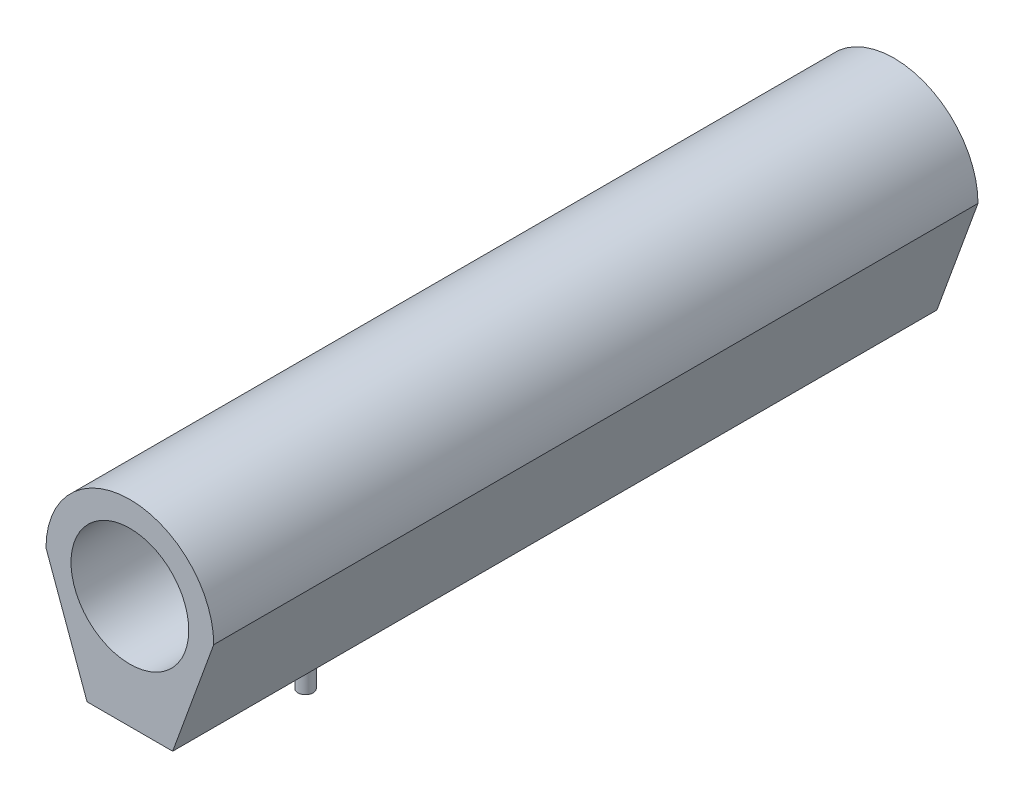
ISO-10303-21;
HEADER;
FILE_DESCRIPTION(('STEP AP214'),'2;1');
FILE_NAME('part.step','',(''),(''),'','','');
FILE_SCHEMA(('AUTOMOTIVE_DESIGN { 1 0 10303 214 1 1 1 1 }'));
ENDSEC;
DATA;
#1=APPLICATION_CONTEXT('core data for automotive mechanical design processes');
#2=APPLICATION_PROTOCOL_DEFINITION('international standard','automotive_design',2000,#1);
#3=PRODUCT_CONTEXT('',#1,'mechanical');
#4=PRODUCT('Part','Part','',(#3));
#5=PRODUCT_RELATED_PRODUCT_CATEGORY('part','',(#4));
#6=PRODUCT_DEFINITION_FORMATION('','',#4);
#7=PRODUCT_DEFINITION_CONTEXT('part definition',#1,'design');
#8=PRODUCT_DEFINITION('design','',#6,#7);
#9=PRODUCT_DEFINITION_SHAPE('','',#8);
#10=(LENGTH_UNIT() NAMED_UNIT(*) SI_UNIT(.MILLI.,.METRE.));
#11=(NAMED_UNIT(*) PLANE_ANGLE_UNIT() SI_UNIT($,.RADIAN.));
#12=(NAMED_UNIT(*) SI_UNIT($,.STERADIAN.) SOLID_ANGLE_UNIT());
#13=UNCERTAINTY_MEASURE_WITH_UNIT(LENGTH_MEASURE(1.E-05),#10,'distance_accuracy_value','');
#14=(GEOMETRIC_REPRESENTATION_CONTEXT(3) GLOBAL_UNCERTAINTY_ASSIGNED_CONTEXT((#13)) GLOBAL_UNIT_ASSIGNED_CONTEXT((#10,
#11,#12)) REPRESENTATION_CONTEXT('',''));
#15=CARTESIAN_POINT('',(0.,0.,0.));
#16=DIRECTION('',(0.,0.,1.));
#17=DIRECTION('',(1.,0.,0.));
#18=AXIS2_PLACEMENT_3D('',#15,#16,#17);
#19=CARTESIAN_POINT('',(-13.75,0.,0.));
#20=DIRECTION('',(-0.939692620785908,-0.34202014332567,0.));
#21=DIRECTION('',(0.34202014332567,-0.939692620785908,0.));
#22=AXIS2_PLACEMENT_3D('',#19,#20,#21);
#23=PLANE('',#22);
#24=DIRECTION('',(0.34202014332567,-0.939692620785908,0.));
#25=VECTOR('',#24,1.);
#26=CARTESIAN_POINT('',(-13.75,0.,125.3));
#27=LINE('',#26,#25);
#28=CARTESIAN_POINT('',(-13.75,0.,125.3));
#29=VERTEX_POINT('',#28);
#30=CARTESIAN_POINT('',(-7.01655066607523,-18.5,125.3));
#31=VERTEX_POINT('',#30);
#32=EDGE_CURVE('E103',#29,#31,#27,.T.);
#33=ORIENTED_EDGE('',*,*,#32,.F.);
#34=DIRECTION('',(0.,0.,1.));
#35=VECTOR('',#34,1.);
#36=CARTESIAN_POINT('',(-13.75,0.,0.));
#37=LINE('',#36,#35);
#38=CARTESIAN_POINT('',(-13.75,0.,0.));
#39=VERTEX_POINT('',#38);
#40=EDGE_CURVE('E44',#39,#29,#37,.T.);
#41=ORIENTED_EDGE('',*,*,#40,.F.);
#42=DIRECTION('',(0.34202014332567,-0.939692620785908,0.));
#43=VECTOR('',#42,1.);
#44=CARTESIAN_POINT('',(-13.75,0.,0.));
#45=LINE('',#44,#43);
#46=CARTESIAN_POINT('',(-7.01655066607523,-18.5,0.));
#47=VERTEX_POINT('',#46);
#48=EDGE_CURVE('E96',#39,#47,#45,.T.);
#49=ORIENTED_EDGE('',*,*,#48,.T.);
#50=DIRECTION('',(0.,0.,1.));
#51=VECTOR('',#50,1.);
#52=CARTESIAN_POINT('',(-7.01655066607523,-18.5,0.));
#53=LINE('',#52,#51);
#54=EDGE_CURVE('E79',#47,#31,#53,.T.);
#55=ORIENTED_EDGE('',*,*,#54,.T.);
#56=EDGE_LOOP('',(#33,#41,#49,#55));
#57=FACE_BOUND('',#56,.T.);
#58=ADVANCED_FACE('F36',(#57),#23,.T.);
#59=CARTESIAN_POINT('',(0.,0.,0.));
#60=DIRECTION('',(0.,0.,1.));
#61=DIRECTION('',(1.,0.,0.));
#62=AXIS2_PLACEMENT_3D('',#59,#60,#61);
#63=CYLINDRICAL_SURFACE('',#62,13.75);
#64=CARTESIAN_POINT('',(0.,0.,125.3));
#65=DIRECTION('',(0.,0.,1.));
#66=DIRECTION('',(1.,0.,0.));
#67=AXIS2_PLACEMENT_3D('',#64,#65,#66);
#68=CIRCLE('',#67,13.75);
#69=CARTESIAN_POINT('',(13.75,0.,125.3));
#70=VERTEX_POINT('',#69);
#71=EDGE_CURVE('E98',#70,#29,#68,.T.);
#72=ORIENTED_EDGE('',*,*,#71,.F.);
#73=DIRECTION('',(0.,0.,1.));
#74=VECTOR('',#73,1.);
#75=CARTESIAN_POINT('',(13.75,0.,0.));
#76=LINE('',#75,#74);
#77=CARTESIAN_POINT('',(13.75,0.,0.));
#78=VERTEX_POINT('',#77);
#79=EDGE_CURVE('E68',#78,#70,#76,.T.);
#80=ORIENTED_EDGE('',*,*,#79,.F.);
#81=CARTESIAN_POINT('',(0.,0.,0.));
#82=DIRECTION('',(0.,0.,1.));
#83=DIRECTION('',(1.,0.,0.));
#84=AXIS2_PLACEMENT_3D('',#81,#82,#83);
#85=CIRCLE('',#84,13.75);
#86=EDGE_CURVE('E93',#78,#39,#85,.T.);
#87=ORIENTED_EDGE('',*,*,#86,.T.);
#88=ORIENTED_EDGE('',*,*,#40,.T.);
#89=EDGE_LOOP('',(#72,#80,#87,#88));
#90=FACE_BOUND('',#89,.T.);
#91=ADVANCED_FACE('F115',(#90),#63,.T.);
#92=CARTESIAN_POINT('',(13.75,0.,0.));
#93=DIRECTION('',(0.939692620785908,-0.34202014332567,0.));
#94=DIRECTION('',(0.34202014332567,0.939692620785908,0.));
#95=AXIS2_PLACEMENT_3D('',#92,#93,#94);
#96=PLANE('',#95);
#97=DIRECTION('',(0.34202014332567,0.939692620785908,0.));
#98=VECTOR('',#97,1.);
#99=CARTESIAN_POINT('',(13.75,0.,125.3));
#100=LINE('',#99,#98);
#101=CARTESIAN_POINT('',(7.01655066607523,-18.5,125.3));
#102=VERTEX_POINT('',#101);
#103=EDGE_CURVE('E87',#102,#70,#100,.T.);
#104=ORIENTED_EDGE('',*,*,#103,.F.);
#105=DIRECTION('',(0.,0.,1.));
#106=VECTOR('',#105,1.);
#107=CARTESIAN_POINT('',(7.01655066607523,-18.5,0.));
#108=LINE('',#107,#106);
#109=CARTESIAN_POINT('',(7.01655066607523,-18.5,0.));
#110=VERTEX_POINT('',#109);
#111=EDGE_CURVE('E82',#110,#102,#108,.T.);
#112=ORIENTED_EDGE('',*,*,#111,.F.);
#113=DIRECTION('',(0.34202014332567,0.939692620785908,0.));
#114=VECTOR('',#113,1.);
#115=CARTESIAN_POINT('',(13.75,0.,0.));
#116=LINE('',#115,#114);
#117=EDGE_CURVE('E85',#110,#78,#116,.T.);
#118=ORIENTED_EDGE('',*,*,#117,.T.);
#119=ORIENTED_EDGE('',*,*,#79,.T.);
#120=EDGE_LOOP('',(#104,#112,#118,#119));
#121=FACE_BOUND('',#120,.T.);
#122=ADVANCED_FACE('F84',(#121),#96,.T.);
#123=CARTESIAN_POINT('',(-7.01655066607523,-18.5,0.));
#124=DIRECTION('',(0.,-1.,0.));
#125=DIRECTION('',(0.,0.,-1.));
#126=AXIS2_PLACEMENT_3D('',#123,#124,#125);
#127=PLANE('',#126);
#128=CARTESIAN_POINT('',(0.,-18.5,96.5));
#129=DIRECTION('',(0.,-1.,0.));
#130=DIRECTION('',(0.,0.,-1.));
#131=AXIS2_PLACEMENT_3D('',#128,#129,#130);
#132=CIRCLE('',#131,5.75000000000001);
#133=CARTESIAN_POINT('',(0.,-18.5,90.75));
#134=VERTEX_POINT('',#133);
#135=EDGE_CURVE('E11',#134,#134,#132,.T.);
#136=ORIENTED_EDGE('',*,*,#135,.F.);
#137=EDGE_LOOP('',(#136));
#138=FACE_BOUND('',#137,.T.);
#139=DIRECTION('',(1.,0.,0.));
#140=VECTOR('',#139,1.);
#141=CARTESIAN_POINT('',(-7.01655066607523,-18.5,125.3));
#142=LINE('',#141,#140);
#143=EDGE_CURVE('E106',#31,#102,#142,.T.);
#144=ORIENTED_EDGE('',*,*,#143,.F.);
#145=ORIENTED_EDGE('',*,*,#54,.F.);
#146=DIRECTION('',(1.,0.,0.));
#147=VECTOR('',#146,1.);
#148=CARTESIAN_POINT('',(-7.01655066607523,-18.5,0.));
#149=LINE('',#148,#147);
#150=EDGE_CURVE('E92',#47,#110,#149,.T.);
#151=ORIENTED_EDGE('',*,*,#150,.T.);
#152=ORIENTED_EDGE('',*,*,#111,.T.);
#153=EDGE_LOOP('',(#144,#145,#151,#152));
#154=FACE_BOUND('',#153,.T.);
#155=ADVANCED_FACE('F95',(#138,#154),#127,.T.);
#156=CARTESIAN_POINT('',(0.,0.,0.));
#157=DIRECTION('',(0.,0.,1.));
#158=DIRECTION('',(1.,0.,0.));
#159=AXIS2_PLACEMENT_3D('',#156,#157,#158);
#160=PLANE('',#159);
#161=CARTESIAN_POINT('',(0.,0.,0.));
#162=DIRECTION('',(0.,0.,1.));
#163=DIRECTION('',(1.,0.,0.));
#164=AXIS2_PLACEMENT_3D('',#161,#162,#163);
#165=CIRCLE('',#164,9.65);
#166=CARTESIAN_POINT('',(9.65,0.,0.));
#167=VERTEX_POINT('',#166);
#168=EDGE_CURVE('E107',#167,#167,#165,.T.);
#169=ORIENTED_EDGE('',*,*,#168,.T.);
#170=EDGE_LOOP('',(#169));
#171=FACE_BOUND('',#170,.T.);
#172=ORIENTED_EDGE('',*,*,#48,.F.);
#173=ORIENTED_EDGE('',*,*,#86,.F.);
#174=ORIENTED_EDGE('',*,*,#117,.F.);
#175=ORIENTED_EDGE('',*,*,#150,.F.);
#176=EDGE_LOOP('',(#172,#173,#174,#175));
#177=FACE_BOUND('',#176,.T.);
#178=ADVANCED_FACE('F91',(#171,#177),#160,.F.);
#179=CARTESIAN_POINT('',(0.,0.,125.3));
#180=DIRECTION('',(0.,0.,1.));
#181=DIRECTION('',(1.,0.,0.));
#182=AXIS2_PLACEMENT_3D('',#179,#180,#181);
#183=PLANE('',#182);
#184=CARTESIAN_POINT('',(0.,0.,125.3));
#185=DIRECTION('',(0.,0.,1.));
#186=DIRECTION('',(1.,0.,0.));
#187=AXIS2_PLACEMENT_3D('',#184,#185,#186);
#188=CIRCLE('',#187,9.65);
#189=CARTESIAN_POINT('',(9.65,0.,125.3));
#190=VERTEX_POINT('',#189);
#191=EDGE_CURVE('E143',#190,#190,#188,.T.);
#192=ORIENTED_EDGE('',*,*,#191,.F.);
#193=EDGE_LOOP('',(#192));
#194=FACE_BOUND('',#193,.T.);
#195=ORIENTED_EDGE('',*,*,#32,.T.);
#196=ORIENTED_EDGE('',*,*,#143,.T.);
#197=ORIENTED_EDGE('',*,*,#103,.T.);
#198=ORIENTED_EDGE('',*,*,#71,.T.);
#199=EDGE_LOOP('',(#195,#196,#197,#198));
#200=FACE_BOUND('',#199,.T.);
#201=ADVANCED_FACE('F114',(#194,#200),#183,.T.);
#202=CARTESIAN_POINT('',(0.,0.,0.));
#203=DIRECTION('',(0.,0.,1.));
#204=DIRECTION('',(1.,0.,0.));
#205=AXIS2_PLACEMENT_3D('',#202,#203,#204);
#206=CYLINDRICAL_SURFACE('',#205,9.65);
#207=ORIENTED_EDGE('',*,*,#168,.F.);
#208=EDGE_LOOP('',(#207));
#209=FACE_BOUND('',#208,.T.);
#210=ORIENTED_EDGE('',*,*,#191,.T.);
#211=EDGE_LOOP('',(#210));
#212=FACE_BOUND('',#211,.T.);
#213=ADVANCED_FACE('F155',(#209,#212),#206,.F.);
#214=CARTESIAN_POINT('',(0.,-20.75,91.9212758637414));
#215=DIRECTION('',(0.,-1.,0.));
#216=DIRECTION('',(0.,0.,-1.));
#217=AXIS2_PLACEMENT_3D('',#214,#215,#216);
#218=PLANE('',#217);
#219=CARTESIAN_POINT('',(0.,-20.75,96.5));
#220=DIRECTION('',(0.,-1.,0.));
#221=DIRECTION('',(0.,0.,-1.));
#222=AXIS2_PLACEMENT_3D('',#219,#220,#221);
#223=CIRCLE('',#222,4.57872413625861);
#224=CARTESIAN_POINT('',(0.,-20.75,91.9212758637414));
#225=VERTEX_POINT('',#224);
#226=EDGE_CURVE('E141',#225,#225,#223,.T.);
#227=ORIENTED_EDGE('',*,*,#226,.T.);
#228=EDGE_LOOP('',(#227));
#229=FACE_BOUND('',#228,.T.);
#230=CARTESIAN_POINT('',(0.,-20.75,96.5));
#231=DIRECTION('',(0.,-1.,0.));
#232=DIRECTION('',(0.,0.,-1.));
#233=AXIS2_PLACEMENT_3D('',#230,#231,#232);
#234=CIRCLE('',#233,3.4212758637414);
#235=CARTESIAN_POINT('',(0.,-20.75,93.0787241362586));
#236=VERTEX_POINT('',#235);
#237=EDGE_CURVE('E258',#236,#236,#234,.T.);
#238=ORIENTED_EDGE('',*,*,#237,.F.);
#239=EDGE_LOOP('',(#238));
#240=FACE_BOUND('',#239,.T.);
#241=ADVANCED_FACE('F137',(#229,#240),#218,.T.);
#242=CARTESIAN_POINT('',(0.,-20.75,96.5));
#243=DIRECTION('',(0.,1.,0.));
#244=DIRECTION('',(0.,0.,1.));
#245=AXIS2_PLACEMENT_3D('',#242,#243,#244);
#246=CONICAL_SURFACE('',#245,4.57872413625861,0.47996554429843);
#247=ORIENTED_EDGE('',*,*,#135,.T.);
#248=EDGE_LOOP('',(#247));
#249=FACE_BOUND('',#248,.T.);
#250=ORIENTED_EDGE('',*,*,#226,.F.);
#251=EDGE_LOOP('',(#250));
#252=FACE_BOUND('',#251,.T.);
#253=ADVANCED_FACE('F133',(#249,#252),#246,.T.);
#254=CARTESIAN_POINT('',(0.,-27.5,95.25));
#255=DIRECTION('',(0.,-1.,0.));
#256=DIRECTION('',(0.,0.,-1.));
#257=AXIS2_PLACEMENT_3D('',#254,#255,#256);
#258=PLANE('',#257);
#259=CARTESIAN_POINT('',(0.,-27.5,96.5));
#260=DIRECTION('',(0.,-1.,0.));
#261=DIRECTION('',(0.,0.,-1.));
#262=AXIS2_PLACEMENT_3D('',#259,#260,#261);
#263=CIRCLE('',#262,1.25);
#264=CARTESIAN_POINT('',(0.,-27.5,95.25));
#265=VERTEX_POINT('',#264);
#266=EDGE_CURVE('E144',#265,#265,#263,.T.);
#267=ORIENTED_EDGE('',*,*,#266,.T.);
#268=EDGE_LOOP('',(#267));
#269=FACE_BOUND('',#268,.T.);
#270=ADVANCED_FACE('F136',(#269),#258,.T.);
#271=CARTESIAN_POINT('',(0.,-23.,96.5));
#272=DIRECTION('',(0.,-1.,0.));
#273=DIRECTION('',(0.,0.,-1.));
#274=AXIS2_PLACEMENT_3D('',#271,#272,#273);
#275=CYLINDRICAL_SURFACE('',#274,1.25);
#276=CARTESIAN_POINT('',(0.,-23.,96.5));
#277=DIRECTION('',(0.,-1.,0.));
#278=DIRECTION('',(0.,0.,-1.));
#279=AXIS2_PLACEMENT_3D('',#276,#277,#278);
#280=CIRCLE('',#279,1.25);
#281=CARTESIAN_POINT('',(0.,-23.,95.25));
#282=VERTEX_POINT('',#281);
#283=EDGE_CURVE('E148',#282,#282,#280,.T.);
#284=ORIENTED_EDGE('',*,*,#283,.T.);
#285=EDGE_LOOP('',(#284));
#286=FACE_BOUND('',#285,.T.);
#287=ORIENTED_EDGE('',*,*,#266,.F.);
#288=EDGE_LOOP('',(#287));
#289=FACE_BOUND('',#288,.T.);
#290=ADVANCED_FACE('F186',(#286,#289),#275,.T.);
#291=CARTESIAN_POINT('',(0.,-23.,94.25));
#292=DIRECTION('',(0.,-1.,0.));
#293=DIRECTION('',(0.,0.,-1.));
#294=AXIS2_PLACEMENT_3D('',#291,#292,#293);
#295=PLANE('',#294);
#296=CARTESIAN_POINT('',(0.,-23.,96.5));
#297=DIRECTION('',(0.,-1.,0.));
#298=DIRECTION('',(0.,0.,-1.));
#299=AXIS2_PLACEMENT_3D('',#296,#297,#298);
#300=CIRCLE('',#299,2.25);
#301=CARTESIAN_POINT('',(0.,-23.,94.25));
#302=VERTEX_POINT('',#301);
#303=EDGE_CURVE('E261',#302,#302,#300,.T.);
#304=ORIENTED_EDGE('',*,*,#303,.T.);
#305=EDGE_LOOP('',(#304));
#306=FACE_BOUND('',#305,.T.);
#307=ORIENTED_EDGE('',*,*,#283,.F.);
#308=EDGE_LOOP('',(#307));
#309=FACE_BOUND('',#308,.T.);
#310=ADVANCED_FACE('F195',(#306,#309),#295,.T.);
#311=CARTESIAN_POINT('',(0.,-23.,96.5));
#312=DIRECTION('',(0.,1.,0.));
#313=DIRECTION('',(0.,0.,1.));
#314=AXIS2_PLACEMENT_3D('',#311,#312,#313);
#315=CONICAL_SURFACE('',#314,2.25,0.47996554429843);
#316=ORIENTED_EDGE('',*,*,#237,.T.);
#317=EDGE_LOOP('',(#316));
#318=FACE_BOUND('',#317,.T.);
#319=ORIENTED_EDGE('',*,*,#303,.F.);
#320=EDGE_LOOP('',(#319));
#321=FACE_BOUND('',#320,.T.);
#322=ADVANCED_FACE('F202',(#318,#321),#315,.T.);
#323=CLOSED_SHELL('',(#58,#91,#122,#155,#178,#201,#213,#241,#253,#270,#290,#310,#322));
#324=MANIFOLD_SOLID_BREP('B2',#323);
#325=ADVANCED_BREP_SHAPE_REPRESENTATION('',(#18,#324),#14);
#326=SHAPE_DEFINITION_REPRESENTATION(#9,#325);
ENDSEC;
END-ISO-10303-21;
